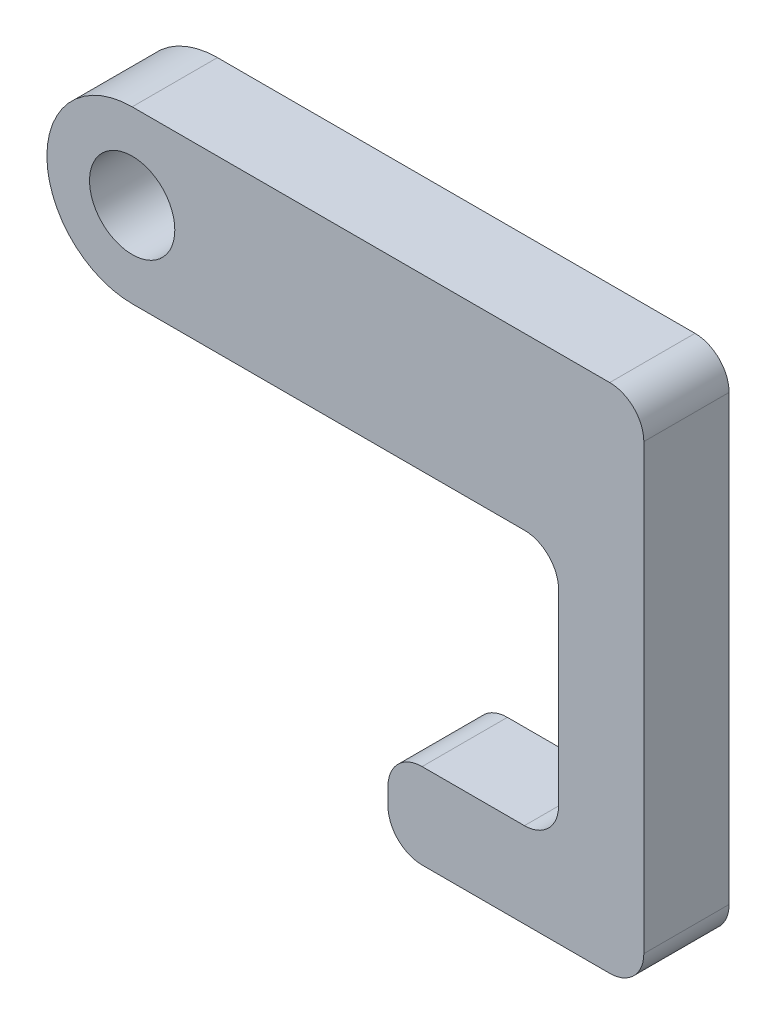
ISO-10303-21;
HEADER;
FILE_DESCRIPTION(('STEP AP214'),'2;1');
FILE_NAME('part.step','',(''),(''),'','','');
FILE_SCHEMA(('AUTOMOTIVE_DESIGN { 1 0 10303 214 1 1 1 1 }'));
ENDSEC;
DATA;
#1=APPLICATION_CONTEXT('core data for automotive mechanical design processes');
#2=APPLICATION_PROTOCOL_DEFINITION('international standard','automotive_design',2000,#1);
#3=PRODUCT_CONTEXT('',#1,'mechanical');
#4=PRODUCT('Part','Part','',(#3));
#5=PRODUCT_RELATED_PRODUCT_CATEGORY('part','',(#4));
#6=PRODUCT_DEFINITION_FORMATION('','',#4);
#7=PRODUCT_DEFINITION_CONTEXT('part definition',#1,'design');
#8=PRODUCT_DEFINITION('design','',#6,#7);
#9=PRODUCT_DEFINITION_SHAPE('','',#8);
#10=(LENGTH_UNIT() NAMED_UNIT(*) SI_UNIT(.MILLI.,.METRE.));
#11=(NAMED_UNIT(*) PLANE_ANGLE_UNIT() SI_UNIT($,.RADIAN.));
#12=(NAMED_UNIT(*) SI_UNIT($,.STERADIAN.) SOLID_ANGLE_UNIT());
#13=UNCERTAINTY_MEASURE_WITH_UNIT(LENGTH_MEASURE(1.E-05),#10,'distance_accuracy_value','');
#14=(GEOMETRIC_REPRESENTATION_CONTEXT(3) GLOBAL_UNCERTAINTY_ASSIGNED_CONTEXT((#13)) GLOBAL_UNIT_ASSIGNED_CONTEXT((#10,
#11,#12)) REPRESENTATION_CONTEXT('',''));
#15=CARTESIAN_POINT('',(0.,0.,0.));
#16=DIRECTION('',(0.,0.,1.));
#17=DIRECTION('',(1.,0.,0.));
#18=AXIS2_PLACEMENT_3D('',#15,#16,#17);
#19=CARTESIAN_POINT('',(-15.,0.,5.));
#20=DIRECTION('',(0.,0.,1.));
#21=DIRECTION('',(1.,0.,0.));
#22=AXIS2_PLACEMENT_3D('',#19,#20,#21);
#23=PLANE('',#22);
#24=DIRECTION('',(1.,0.,0.));
#25=VECTOR('',#24,1.);
#26=CARTESIAN_POINT('',(0.,-25.,5.));
#27=LINE('',#26,#25);
#28=CARTESIAN_POINT('',(2.00000000000001,-25.,5.));
#29=VERTEX_POINT('',#28);
#30=CARTESIAN_POINT('',(13.,-25.,5.));
#31=VERTEX_POINT('',#30);
#32=EDGE_CURVE('E174',#29,#31,#27,.T.);
#33=ORIENTED_EDGE('',*,*,#32,.T.);
#34=CARTESIAN_POINT('',(13.,-23.,5.));
#35=DIRECTION('',(0.,0.,1.));
#36=DIRECTION('',(1.,0.,0.));
#37=AXIS2_PLACEMENT_3D('',#34,#35,#36);
#38=CIRCLE('',#37,2.);
#39=CARTESIAN_POINT('',(15.,-23.,5.));
#40=VERTEX_POINT('',#39);
#41=EDGE_CURVE('E219',#31,#40,#38,.T.);
#42=ORIENTED_EDGE('',*,*,#41,.T.);
#43=DIRECTION('',(0.,1.,0.));
#44=VECTOR('',#43,1.);
#45=CARTESIAN_POINT('',(15.,-25.,5.));
#46=LINE('',#45,#44);
#47=CARTESIAN_POINT('',(15.,3.,5.));
#48=VERTEX_POINT('',#47);
#49=EDGE_CURVE('E147',#40,#48,#46,.T.);
#50=ORIENTED_EDGE('',*,*,#49,.T.);
#51=CARTESIAN_POINT('',(13.,3.,5.));
#52=DIRECTION('',(0.,0.,1.));
#53=DIRECTION('',(1.,0.,0.));
#54=AXIS2_PLACEMENT_3D('',#51,#52,#53);
#55=CIRCLE('',#54,2.);
#56=CARTESIAN_POINT('',(13.,5.,5.));
#57=VERTEX_POINT('',#56);
#58=EDGE_CURVE('E143',#48,#57,#55,.T.);
#59=ORIENTED_EDGE('',*,*,#58,.T.);
#60=DIRECTION('',(-1.,0.,0.));
#61=VECTOR('',#60,1.);
#62=CARTESIAN_POINT('',(-15.,5.,5.));
#63=LINE('',#62,#61);
#64=CARTESIAN_POINT('',(-15.,5.,5.));
#65=VERTEX_POINT('',#64);
#66=EDGE_CURVE('E133',#57,#65,#63,.T.);
#67=ORIENTED_EDGE('',*,*,#66,.T.);
#68=CARTESIAN_POINT('',(-15.,0.,5.));
#69=DIRECTION('',(0.,0.,1.));
#70=DIRECTION('',(1.,0.,0.));
#71=AXIS2_PLACEMENT_3D('',#68,#69,#70);
#72=CIRCLE('',#71,5.);
#73=CARTESIAN_POINT('',(-15.,-5.,5.));
#74=VERTEX_POINT('',#73);
#75=EDGE_CURVE('E139',#65,#74,#72,.T.);
#76=ORIENTED_EDGE('',*,*,#75,.T.);
#77=DIRECTION('',(1.,0.,0.));
#78=VECTOR('',#77,1.);
#79=CARTESIAN_POINT('',(-15.,-5.,5.));
#80=LINE('',#79,#78);
#81=CARTESIAN_POINT('',(8.,-5.,5.));
#82=VERTEX_POINT('',#81);
#83=EDGE_CURVE('E162',#74,#82,#80,.T.);
#84=ORIENTED_EDGE('',*,*,#83,.T.);
#85=CARTESIAN_POINT('',(8.00000000000001,-7.,5.));
#86=DIRECTION('',(0.,0.,1.));
#87=DIRECTION('',(1.,0.,0.));
#88=AXIS2_PLACEMENT_3D('',#85,#86,#87);
#89=CIRCLE('',#88,2.);
#90=CARTESIAN_POINT('',(10.,-7.,5.));
#91=VERTEX_POINT('',#90);
#92=EDGE_CURVE('E11',#82,#91,#89,.F.);
#93=ORIENTED_EDGE('',*,*,#92,.T.);
#94=DIRECTION('',(0.,-1.,0.));
#95=VECTOR('',#94,1.);
#96=CARTESIAN_POINT('',(10.,-5.,5.));
#97=LINE('',#96,#95);
#98=CARTESIAN_POINT('',(10.,-18.,5.));
#99=VERTEX_POINT('',#98);
#100=EDGE_CURVE('E164',#91,#99,#97,.T.);
#101=ORIENTED_EDGE('',*,*,#100,.T.);
#102=CARTESIAN_POINT('',(8.00000000000001,-18.,5.));
#103=DIRECTION('',(0.,0.,1.));
#104=DIRECTION('',(1.,0.,0.));
#105=AXIS2_PLACEMENT_3D('',#102,#103,#104);
#106=CIRCLE('',#105,2.);
#107=CARTESIAN_POINT('',(8.00000000000001,-20.,5.));
#108=VERTEX_POINT('',#107);
#109=EDGE_CURVE('E241',#99,#108,#106,.F.);
#110=ORIENTED_EDGE('',*,*,#109,.T.);
#111=DIRECTION('',(-1.,0.,0.));
#112=VECTOR('',#111,1.);
#113=CARTESIAN_POINT('',(10.,-20.,5.));
#114=LINE('',#113,#112);
#115=CARTESIAN_POINT('',(2.00000000000001,-20.,5.));
#116=VERTEX_POINT('',#115);
#117=EDGE_CURVE('E170',#108,#116,#114,.T.);
#118=ORIENTED_EDGE('',*,*,#117,.T.);
#119=CARTESIAN_POINT('',(2.00000000000001,-22.,5.));
#120=DIRECTION('',(0.,0.,1.));
#121=DIRECTION('',(1.,0.,0.));
#122=AXIS2_PLACEMENT_3D('',#119,#120,#121);
#123=CIRCLE('',#122,2.);
#124=CARTESIAN_POINT('',(0.,-22.,5.));
#125=VERTEX_POINT('',#124);
#126=EDGE_CURVE('E55',#116,#125,#123,.T.);
#127=ORIENTED_EDGE('',*,*,#126,.T.);
#128=DIRECTION('',(0.,-1.,0.));
#129=VECTOR('',#128,1.);
#130=CARTESIAN_POINT('',(0.,-20.,5.));
#131=LINE('',#130,#129);
#132=CARTESIAN_POINT('',(0.,-23.,5.));
#133=VERTEX_POINT('',#132);
#134=EDGE_CURVE('E172',#125,#133,#131,.T.);
#135=ORIENTED_EDGE('',*,*,#134,.T.);
#136=CARTESIAN_POINT('',(2.00000000000001,-23.,5.));
#137=DIRECTION('',(0.,0.,1.));
#138=DIRECTION('',(1.,0.,0.));
#139=AXIS2_PLACEMENT_3D('',#136,#137,#138);
#140=CIRCLE('',#139,2.);
#141=EDGE_CURVE('E216',#133,#29,#140,.T.);
#142=ORIENTED_EDGE('',*,*,#141,.T.);
#143=EDGE_LOOP('',(#33,#42,#50,#59,#67,#76,#84,#93,#101,#110,#118,#127,#135,#142));
#144=FACE_BOUND('',#143,.T.);
#145=CARTESIAN_POINT('',(-15.,0.,5.));
#146=DIRECTION('',(0.,0.,1.));
#147=DIRECTION('',(1.,0.,0.));
#148=AXIS2_PLACEMENT_3D('',#145,#146,#147);
#149=CIRCLE('',#148,2.5);
#150=CARTESIAN_POINT('',(-12.5,0.,5.));
#151=VERTEX_POINT('',#150);
#152=EDGE_CURVE('E179',#151,#151,#149,.T.);
#153=ORIENTED_EDGE('',*,*,#152,.F.);
#154=EDGE_LOOP('',(#153));
#155=FACE_BOUND('',#154,.T.);
#156=ADVANCED_FACE('F33',(#144,#155),#23,.T.);
#157=CARTESIAN_POINT('',(-15.,0.,0.));
#158=DIRECTION('',(0.,0.,1.));
#159=DIRECTION('',(1.,0.,0.));
#160=AXIS2_PLACEMENT_3D('',#157,#158,#159);
#161=PLANE('',#160);
#162=DIRECTION('',(0.,1.,0.));
#163=VECTOR('',#162,1.);
#164=CARTESIAN_POINT('',(15.,5.,0.));
#165=LINE('',#164,#163);
#166=CARTESIAN_POINT('',(15.,-23.,0.));
#167=VERTEX_POINT('',#166);
#168=CARTESIAN_POINT('',(15.,3.,0.));
#169=VERTEX_POINT('',#168);
#170=EDGE_CURVE('E176',#167,#169,#165,.T.);
#171=ORIENTED_EDGE('',*,*,#170,.F.);
#172=CARTESIAN_POINT('',(13.,-23.,0.));
#173=DIRECTION('',(0.,0.,1.));
#174=DIRECTION('',(1.,0.,0.));
#175=AXIS2_PLACEMENT_3D('',#172,#173,#174);
#176=CIRCLE('',#175,2.);
#177=CARTESIAN_POINT('',(13.,-25.,0.));
#178=VERTEX_POINT('',#177);
#179=EDGE_CURVE('E208',#167,#178,#176,.F.);
#180=ORIENTED_EDGE('',*,*,#179,.T.);
#181=DIRECTION('',(1.,0.,0.));
#182=VECTOR('',#181,1.);
#183=CARTESIAN_POINT('',(0.,-25.,0.));
#184=LINE('',#183,#182);
#185=CARTESIAN_POINT('',(2.00000000000001,-25.,0.));
#186=VERTEX_POINT('',#185);
#187=EDGE_CURVE('E194',#186,#178,#184,.T.);
#188=ORIENTED_EDGE('',*,*,#187,.F.);
#189=CARTESIAN_POINT('',(2.00000000000001,-23.,0.));
#190=DIRECTION('',(0.,0.,1.));
#191=DIRECTION('',(1.,0.,0.));
#192=AXIS2_PLACEMENT_3D('',#189,#190,#191);
#193=CIRCLE('',#192,2.);
#194=CARTESIAN_POINT('',(0.,-23.,0.));
#195=VERTEX_POINT('',#194);
#196=EDGE_CURVE('E204',#186,#195,#193,.F.);
#197=ORIENTED_EDGE('',*,*,#196,.T.);
#198=DIRECTION('',(0.,-1.,0.));
#199=VECTOR('',#198,1.);
#200=CARTESIAN_POINT('',(0.,-20.,0.));
#201=LINE('',#200,#199);
#202=CARTESIAN_POINT('',(0.,-22.,0.));
#203=VERTEX_POINT('',#202);
#204=EDGE_CURVE('E192',#203,#195,#201,.T.);
#205=ORIENTED_EDGE('',*,*,#204,.F.);
#206=CARTESIAN_POINT('',(2.00000000000001,-22.,0.));
#207=DIRECTION('',(0.,0.,1.));
#208=DIRECTION('',(1.,0.,0.));
#209=AXIS2_PLACEMENT_3D('',#206,#207,#208);
#210=CIRCLE('',#209,2.);
#211=CARTESIAN_POINT('',(2.00000000000001,-20.,0.));
#212=VERTEX_POINT('',#211);
#213=EDGE_CURVE('E202',#203,#212,#210,.F.);
#214=ORIENTED_EDGE('',*,*,#213,.T.);
#215=DIRECTION('',(-1.,0.,0.));
#216=VECTOR('',#215,1.);
#217=CARTESIAN_POINT('',(10.,-20.,0.));
#218=LINE('',#217,#216);
#219=CARTESIAN_POINT('',(8.00000000000001,-20.,0.));
#220=VERTEX_POINT('',#219);
#221=EDGE_CURVE('E189',#220,#212,#218,.T.);
#222=ORIENTED_EDGE('',*,*,#221,.F.);
#223=CARTESIAN_POINT('',(8.00000000000001,-18.,0.));
#224=DIRECTION('',(0.,0.,1.));
#225=DIRECTION('',(1.,0.,0.));
#226=AXIS2_PLACEMENT_3D('',#223,#224,#225);
#227=CIRCLE('',#226,2.);
#228=CARTESIAN_POINT('',(10.,-18.,0.));
#229=VERTEX_POINT('',#228);
#230=EDGE_CURVE('E239',#220,#229,#227,.T.);
#231=ORIENTED_EDGE('',*,*,#230,.T.);
#232=DIRECTION('',(0.,-1.,0.));
#233=VECTOR('',#232,1.);
#234=CARTESIAN_POINT('',(10.,-5.,0.));
#235=LINE('',#234,#233);
#236=CARTESIAN_POINT('',(10.,-7.,0.));
#237=VERTEX_POINT('',#236);
#238=EDGE_CURVE('E186',#237,#229,#235,.T.);
#239=ORIENTED_EDGE('',*,*,#238,.F.);
#240=CARTESIAN_POINT('',(8.00000000000001,-7.,0.));
#241=DIRECTION('',(0.,0.,1.));
#242=DIRECTION('',(1.,0.,0.));
#243=AXIS2_PLACEMENT_3D('',#240,#241,#242);
#244=CIRCLE('',#243,2.);
#245=CARTESIAN_POINT('',(8.,-5.,0.));
#246=VERTEX_POINT('',#245);
#247=EDGE_CURVE('E41',#237,#246,#244,.T.);
#248=ORIENTED_EDGE('',*,*,#247,.T.);
#249=DIRECTION('',(1.,0.,0.));
#250=VECTOR('',#249,1.);
#251=CARTESIAN_POINT('',(-15.,-5.,0.));
#252=LINE('',#251,#250);
#253=CARTESIAN_POINT('',(-15.,-5.,0.));
#254=VERTEX_POINT('',#253);
#255=EDGE_CURVE('E183',#254,#246,#252,.T.);
#256=ORIENTED_EDGE('',*,*,#255,.F.);
#257=CARTESIAN_POINT('',(-15.,0.,0.));
#258=DIRECTION('',(0.,0.,1.));
#259=DIRECTION('',(1.,0.,0.));
#260=AXIS2_PLACEMENT_3D('',#257,#258,#259);
#261=CIRCLE('',#260,5.);
#262=CARTESIAN_POINT('',(-15.,5.,0.));
#263=VERTEX_POINT('',#262);
#264=EDGE_CURVE('E181',#263,#254,#261,.T.);
#265=ORIENTED_EDGE('',*,*,#264,.F.);
#266=DIRECTION('',(-1.,0.,0.));
#267=VECTOR('',#266,1.);
#268=CARTESIAN_POINT('',(-15.,5.,0.));
#269=LINE('',#268,#267);
#270=CARTESIAN_POINT('',(13.,5.,0.));
#271=VERTEX_POINT('',#270);
#272=EDGE_CURVE('E153',#271,#263,#269,.T.);
#273=ORIENTED_EDGE('',*,*,#272,.F.);
#274=CARTESIAN_POINT('',(13.,3.,0.));
#275=DIRECTION('',(0.,0.,1.));
#276=DIRECTION('',(1.,0.,0.));
#277=AXIS2_PLACEMENT_3D('',#274,#275,#276);
#278=CIRCLE('',#277,2.);
#279=EDGE_CURVE('E206',#271,#169,#278,.F.);
#280=ORIENTED_EDGE('',*,*,#279,.T.);
#281=EDGE_LOOP('',(#171,#180,#188,#197,#205,#214,#222,#231,#239,#248,#256,#265,#273,#280));
#282=FACE_BOUND('',#281,.T.);
#283=CARTESIAN_POINT('',(-15.,0.,0.));
#284=DIRECTION('',(0.,0.,1.));
#285=DIRECTION('',(1.,0.,0.));
#286=AXIS2_PLACEMENT_3D('',#283,#284,#285);
#287=CIRCLE('',#286,2.5);
#288=CARTESIAN_POINT('',(-12.5,0.,0.));
#289=VERTEX_POINT('',#288);
#290=EDGE_CURVE('E292',#289,#289,#287,.T.);
#291=ORIENTED_EDGE('',*,*,#290,.T.);
#292=EDGE_LOOP('',(#291));
#293=FACE_BOUND('',#292,.T.);
#294=ADVANCED_FACE('F246',(#282,#293),#161,.F.);
#295=CARTESIAN_POINT('',(15.,5.,5.));
#296=DIRECTION('',(-1.,0.,0.));
#297=DIRECTION('',(0.,-1.,0.));
#298=AXIS2_PLACEMENT_3D('',#295,#296,#297);
#299=PLANE('',#298);
#300=ORIENTED_EDGE('',*,*,#49,.F.);
#301=DIRECTION('',(0.,0.,-1.));
#302=VECTOR('',#301,1.);
#303=CARTESIAN_POINT('',(15.,-23.,5.));
#304=LINE('',#303,#302);
#305=EDGE_CURVE('E199',#40,#167,#304,.T.);
#306=ORIENTED_EDGE('',*,*,#305,.T.);
#307=ORIENTED_EDGE('',*,*,#170,.T.);
#308=DIRECTION('',(0.,0.,-1.));
#309=VECTOR('',#308,1.);
#310=CARTESIAN_POINT('',(15.,3.,5.));
#311=LINE('',#310,#309);
#312=EDGE_CURVE('E156',#169,#48,#311,.F.);
#313=ORIENTED_EDGE('',*,*,#312,.T.);
#314=EDGE_LOOP('',(#300,#306,#307,#313));
#315=FACE_BOUND('',#314,.T.);
#316=ADVANCED_FACE('F287',(#315),#299,.F.);
#317=CARTESIAN_POINT('',(-15.,5.,5.));
#318=DIRECTION('',(0.,-1.,0.));
#319=DIRECTION('',(0.,0.,-1.));
#320=AXIS2_PLACEMENT_3D('',#317,#318,#319);
#321=PLANE('',#320);
#322=ORIENTED_EDGE('',*,*,#66,.F.);
#323=DIRECTION('',(0.,0.,-1.));
#324=VECTOR('',#323,1.);
#325=CARTESIAN_POINT('',(13.,5.,5.));
#326=LINE('',#325,#324);
#327=EDGE_CURVE('E221',#57,#271,#326,.T.);
#328=ORIENTED_EDGE('',*,*,#327,.T.);
#329=ORIENTED_EDGE('',*,*,#272,.T.);
#330=DIRECTION('',(0.,0.,-1.));
#331=VECTOR('',#330,1.);
#332=CARTESIAN_POINT('',(-15.,5.,5.));
#333=LINE('',#332,#331);
#334=EDGE_CURVE('E150',#65,#263,#333,.T.);
#335=ORIENTED_EDGE('',*,*,#334,.F.);
#336=EDGE_LOOP('',(#322,#328,#329,#335));
#337=FACE_BOUND('',#336,.T.);
#338=ADVANCED_FACE('F151',(#337),#321,.F.);
#339=CARTESIAN_POINT('',(-15.,0.,5.));
#340=DIRECTION('',(0.,0.,-1.));
#341=DIRECTION('',(-1.,0.,0.));
#342=AXIS2_PLACEMENT_3D('',#339,#340,#341);
#343=CYLINDRICAL_SURFACE('',#342,5.);
#344=ORIENTED_EDGE('',*,*,#264,.T.);
#345=DIRECTION('',(0.,0.,-1.));
#346=VECTOR('',#345,1.);
#347=CARTESIAN_POINT('',(-15.,-5.,5.));
#348=LINE('',#347,#346);
#349=EDGE_CURVE('E157',#74,#254,#348,.T.);
#350=ORIENTED_EDGE('',*,*,#349,.F.);
#351=ORIENTED_EDGE('',*,*,#75,.F.);
#352=ORIENTED_EDGE('',*,*,#334,.T.);
#353=EDGE_LOOP('',(#344,#350,#351,#352));
#354=FACE_BOUND('',#353,.T.);
#355=ADVANCED_FACE('F159',(#354),#343,.T.);
#356=CARTESIAN_POINT('',(-15.,-5.,5.));
#357=DIRECTION('',(0.,1.,0.));
#358=DIRECTION('',(0.,0.,1.));
#359=AXIS2_PLACEMENT_3D('',#356,#357,#358);
#360=PLANE('',#359);
#361=ORIENTED_EDGE('',*,*,#255,.T.);
#362=DIRECTION('',(0.,0.,-1.));
#363=VECTOR('',#362,1.);
#364=CARTESIAN_POINT('',(8.00000000000001,-5.,5.));
#365=LINE('',#364,#363);
#366=EDGE_CURVE('E237',#246,#82,#365,.F.);
#367=ORIENTED_EDGE('',*,*,#366,.T.);
#368=ORIENTED_EDGE('',*,*,#83,.F.);
#369=ORIENTED_EDGE('',*,*,#349,.T.);
#370=EDGE_LOOP('',(#361,#367,#368,#369));
#371=FACE_BOUND('',#370,.T.);
#372=ADVANCED_FACE('F252',(#371),#360,.F.);
#373=CARTESIAN_POINT('',(10.,-5.,5.));
#374=DIRECTION('',(1.,0.,0.));
#375=DIRECTION('',(0.,1.,0.));
#376=AXIS2_PLACEMENT_3D('',#373,#374,#375);
#377=PLANE('',#376);
#378=ORIENTED_EDGE('',*,*,#238,.T.);
#379=DIRECTION('',(0.,0.,-1.));
#380=VECTOR('',#379,1.);
#381=CARTESIAN_POINT('',(10.,-18.,5.));
#382=LINE('',#381,#380);
#383=EDGE_CURVE('E235',#229,#99,#382,.F.);
#384=ORIENTED_EDGE('',*,*,#383,.T.);
#385=ORIENTED_EDGE('',*,*,#100,.F.);
#386=DIRECTION('',(0.,0.,-1.));
#387=VECTOR('',#386,1.);
#388=CARTESIAN_POINT('',(10.,-7.,0.));
#389=LINE('',#388,#387);
#390=EDGE_CURVE('E232',#91,#237,#389,.T.);
#391=ORIENTED_EDGE('',*,*,#390,.T.);
#392=EDGE_LOOP('',(#378,#384,#385,#391));
#393=FACE_BOUND('',#392,.T.);
#394=ADVANCED_FACE('F257',(#393),#377,.F.);
#395=CARTESIAN_POINT('',(10.,-20.,5.));
#396=DIRECTION('',(0.,-1.,0.));
#397=DIRECTION('',(0.,0.,-1.));
#398=AXIS2_PLACEMENT_3D('',#395,#396,#397);
#399=PLANE('',#398);
#400=ORIENTED_EDGE('',*,*,#221,.T.);
#401=DIRECTION('',(0.,0.,-1.));
#402=VECTOR('',#401,1.);
#403=CARTESIAN_POINT('',(2.00000000000001,-20.,5.));
#404=LINE('',#403,#402);
#405=EDGE_CURVE('E230',#212,#116,#404,.F.);
#406=ORIENTED_EDGE('',*,*,#405,.T.);
#407=ORIENTED_EDGE('',*,*,#117,.F.);
#408=DIRECTION('',(0.,0.,-1.));
#409=VECTOR('',#408,1.);
#410=CARTESIAN_POINT('',(8.00000000000001,-20.,0.));
#411=LINE('',#410,#409);
#412=EDGE_CURVE('E227',#108,#220,#411,.T.);
#413=ORIENTED_EDGE('',*,*,#412,.T.);
#414=EDGE_LOOP('',(#400,#406,#407,#413));
#415=FACE_BOUND('',#414,.T.);
#416=ADVANCED_FACE('F264',(#415),#399,.F.);
#417=CARTESIAN_POINT('',(0.,-20.,5.));
#418=DIRECTION('',(1.,0.,0.));
#419=DIRECTION('',(0.,1.,0.));
#420=AXIS2_PLACEMENT_3D('',#417,#418,#419);
#421=PLANE('',#420);
#422=ORIENTED_EDGE('',*,*,#204,.T.);
#423=DIRECTION('',(0.,0.,-1.));
#424=VECTOR('',#423,1.);
#425=CARTESIAN_POINT('',(0.,-23.,5.));
#426=LINE('',#425,#424);
#427=EDGE_CURVE('E48',#195,#133,#426,.F.);
#428=ORIENTED_EDGE('',*,*,#427,.T.);
#429=ORIENTED_EDGE('',*,*,#134,.F.);
#430=DIRECTION('',(0.,0.,-1.));
#431=VECTOR('',#430,1.);
#432=CARTESIAN_POINT('',(0.,-22.,5.));
#433=LINE('',#432,#431);
#434=EDGE_CURVE('E223',#125,#203,#433,.T.);
#435=ORIENTED_EDGE('',*,*,#434,.T.);
#436=EDGE_LOOP('',(#422,#428,#429,#435));
#437=FACE_BOUND('',#436,.T.);
#438=ADVANCED_FACE('F271',(#437),#421,.F.);
#439=CARTESIAN_POINT('',(0.,-25.,5.));
#440=DIRECTION('',(0.,1.,0.));
#441=DIRECTION('',(0.,0.,1.));
#442=AXIS2_PLACEMENT_3D('',#439,#440,#441);
#443=PLANE('',#442);
#444=ORIENTED_EDGE('',*,*,#187,.T.);
#445=DIRECTION('',(0.,0.,-1.));
#446=VECTOR('',#445,1.);
#447=CARTESIAN_POINT('',(13.,-25.,5.));
#448=LINE('',#447,#446);
#449=EDGE_CURVE('E213',#178,#31,#448,.F.);
#450=ORIENTED_EDGE('',*,*,#449,.T.);
#451=ORIENTED_EDGE('',*,*,#32,.F.);
#452=DIRECTION('',(0.,0.,-1.));
#453=VECTOR('',#452,1.);
#454=CARTESIAN_POINT('',(2.00000000000001,-25.,5.));
#455=LINE('',#454,#453);
#456=EDGE_CURVE('E210',#29,#186,#455,.T.);
#457=ORIENTED_EDGE('',*,*,#456,.T.);
#458=EDGE_LOOP('',(#444,#450,#451,#457));
#459=FACE_BOUND('',#458,.T.);
#460=ADVANCED_FACE('F279',(#459),#443,.F.);
#461=CARTESIAN_POINT('',(-15.,0.,5.));
#462=DIRECTION('',(0.,0.,-1.));
#463=DIRECTION('',(-1.,0.,0.));
#464=AXIS2_PLACEMENT_3D('',#461,#462,#463);
#465=CYLINDRICAL_SURFACE('',#464,2.5);
#466=ORIENTED_EDGE('',*,*,#152,.T.);
#467=EDGE_LOOP('',(#466));
#468=FACE_BOUND('',#467,.T.);
#469=ORIENTED_EDGE('',*,*,#290,.F.);
#470=EDGE_LOOP('',(#469));
#471=FACE_BOUND('',#470,.T.);
#472=ADVANCED_FACE('F298',(#468,#471),#465,.F.);
#473=CARTESIAN_POINT('',(13.,-23.,5.));
#474=DIRECTION('',(0.,0.,-1.));
#475=DIRECTION('',(-1.,0.,0.));
#476=AXIS2_PLACEMENT_3D('',#473,#474,#475);
#477=CYLINDRICAL_SURFACE('',#476,2.);
#478=ORIENTED_EDGE('',*,*,#41,.F.);
#479=ORIENTED_EDGE('',*,*,#449,.F.);
#480=ORIENTED_EDGE('',*,*,#179,.F.);
#481=ORIENTED_EDGE('',*,*,#305,.F.);
#482=EDGE_LOOP('',(#478,#479,#480,#481));
#483=FACE_BOUND('',#482,.T.);
#484=ADVANCED_FACE('F285',(#483),#477,.T.);
#485=CARTESIAN_POINT('',(13.,3.,5.));
#486=DIRECTION('',(0.,0.,-1.));
#487=DIRECTION('',(-1.,0.,0.));
#488=AXIS2_PLACEMENT_3D('',#485,#486,#487);
#489=CYLINDRICAL_SURFACE('',#488,2.);
#490=ORIENTED_EDGE('',*,*,#58,.F.);
#491=ORIENTED_EDGE('',*,*,#312,.F.);
#492=ORIENTED_EDGE('',*,*,#279,.F.);
#493=ORIENTED_EDGE('',*,*,#327,.F.);
#494=EDGE_LOOP('',(#490,#491,#492,#493));
#495=FACE_BOUND('',#494,.T.);
#496=ADVANCED_FACE('F290',(#495),#489,.T.);
#497=CARTESIAN_POINT('',(2.00000000000001,-23.,5.));
#498=DIRECTION('',(0.,0.,-1.));
#499=DIRECTION('',(-1.,0.,0.));
#500=AXIS2_PLACEMENT_3D('',#497,#498,#499);
#501=CYLINDRICAL_SURFACE('',#500,2.);
#502=ORIENTED_EDGE('',*,*,#141,.F.);
#503=ORIENTED_EDGE('',*,*,#427,.F.);
#504=ORIENTED_EDGE('',*,*,#196,.F.);
#505=ORIENTED_EDGE('',*,*,#456,.F.);
#506=EDGE_LOOP('',(#502,#503,#504,#505));
#507=FACE_BOUND('',#506,.T.);
#508=ADVANCED_FACE('F276',(#507),#501,.T.);
#509=CARTESIAN_POINT('',(2.00000000000001,-22.,5.));
#510=DIRECTION('',(0.,0.,-1.));
#511=DIRECTION('',(-1.,0.,0.));
#512=AXIS2_PLACEMENT_3D('',#509,#510,#511);
#513=CYLINDRICAL_SURFACE('',#512,2.);
#514=ORIENTED_EDGE('',*,*,#126,.F.);
#515=ORIENTED_EDGE('',*,*,#405,.F.);
#516=ORIENTED_EDGE('',*,*,#213,.F.);
#517=ORIENTED_EDGE('',*,*,#434,.F.);
#518=EDGE_LOOP('',(#514,#515,#516,#517));
#519=FACE_BOUND('',#518,.T.);
#520=ADVANCED_FACE('F268',(#519),#513,.T.);
#521=CARTESIAN_POINT('',(8.00000000000001,-18.,5.));
#522=DIRECTION('',(0.,0.,1.));
#523=DIRECTION('',(1.,0.,0.));
#524=AXIS2_PLACEMENT_3D('',#521,#522,#523);
#525=CYLINDRICAL_SURFACE('',#524,2.);
#526=ORIENTED_EDGE('',*,*,#109,.F.);
#527=ORIENTED_EDGE('',*,*,#383,.F.);
#528=ORIENTED_EDGE('',*,*,#230,.F.);
#529=ORIENTED_EDGE('',*,*,#412,.F.);
#530=EDGE_LOOP('',(#526,#527,#528,#529));
#531=FACE_BOUND('',#530,.T.);
#532=ADVANCED_FACE('F260',(#531),#525,.F.);
#533=CARTESIAN_POINT('',(8.00000000000001,-7.,5.));
#534=DIRECTION('',(0.,0.,1.));
#535=DIRECTION('',(1.,0.,0.));
#536=AXIS2_PLACEMENT_3D('',#533,#534,#535);
#537=CYLINDRICAL_SURFACE('',#536,2.);
#538=ORIENTED_EDGE('',*,*,#92,.F.);
#539=ORIENTED_EDGE('',*,*,#366,.F.);
#540=ORIENTED_EDGE('',*,*,#247,.F.);
#541=ORIENTED_EDGE('',*,*,#390,.F.);
#542=EDGE_LOOP('',(#538,#539,#540,#541));
#543=FACE_BOUND('',#542,.T.);
#544=ADVANCED_FACE('F35',(#543),#537,.F.);
#545=CLOSED_SHELL('',(#156,#294,#316,#338,#355,#372,#394,#416,#438,#460,#472,#484,#496,#508,
#520,#532,#544));
#546=MANIFOLD_SOLID_BREP('B2',#545);
#547=ADVANCED_BREP_SHAPE_REPRESENTATION('',(#18,#546),#14);
#548=SHAPE_DEFINITION_REPRESENTATION(#9,#547);
ENDSEC;
END-ISO-10303-21;
